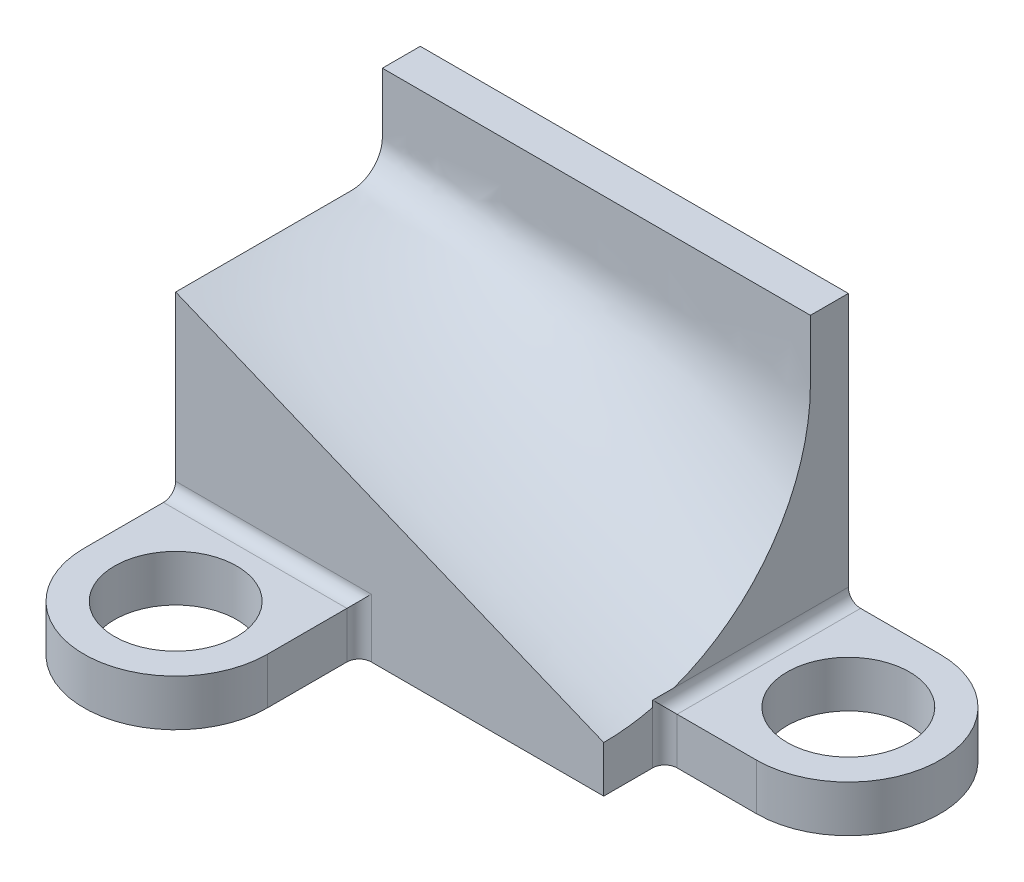
ISO-10303-21;
HEADER;
FILE_DESCRIPTION(('STEP AP214'),'2;1');
FILE_NAME('part.step','',(''),(''),'','','');
FILE_SCHEMA(('AUTOMOTIVE_DESIGN { 1 0 10303 214 1 1 1 1 }'));
ENDSEC;
DATA;
#1=APPLICATION_CONTEXT('core data for automotive mechanical design processes');
#2=APPLICATION_PROTOCOL_DEFINITION('international standard','automotive_design',2000,#1);
#3=PRODUCT_CONTEXT('',#1,'mechanical');
#4=PRODUCT('Part','Part','',(#3));
#5=PRODUCT_RELATED_PRODUCT_CATEGORY('part','',(#4));
#6=PRODUCT_DEFINITION_FORMATION('','',#4);
#7=PRODUCT_DEFINITION_CONTEXT('part definition',#1,'design');
#8=PRODUCT_DEFINITION('design','',#6,#7);
#9=PRODUCT_DEFINITION_SHAPE('','',#8);
#10=(LENGTH_UNIT() NAMED_UNIT(*) SI_UNIT(.MILLI.,.METRE.));
#11=(NAMED_UNIT(*) PLANE_ANGLE_UNIT() SI_UNIT($,.RADIAN.));
#12=(NAMED_UNIT(*) SI_UNIT($,.STERADIAN.) SOLID_ANGLE_UNIT());
#13=UNCERTAINTY_MEASURE_WITH_UNIT(LENGTH_MEASURE(1.E-05),#10,'distance_accuracy_value','');
#14=(GEOMETRIC_REPRESENTATION_CONTEXT(3) GLOBAL_UNCERTAINTY_ASSIGNED_CONTEXT((#13)) GLOBAL_UNIT_ASSIGNED_CONTEXT((#10,
#11,#12)) REPRESENTATION_CONTEXT('',''));
#15=CARTESIAN_POINT('',(0.,0.,0.));
#16=DIRECTION('',(0.,0.,1.));
#17=DIRECTION('',(1.,0.,0.));
#18=AXIS2_PLACEMENT_3D('',#15,#16,#17);
#19=CARTESIAN_POINT('',(0.,9.652,0.));
#20=DIRECTION('',(1.,0.,0.));
#21=DIRECTION('',(0.,0.,-1.));
#22=AXIS2_PLACEMENT_3D('',#19,#20,#21);
#23=PLANE('',#22);
#24=CARTESIAN_POINT('',(0.,52.578,0.));
#25=DIRECTION('',(1.,0.,0.));
#26=DIRECTION('',(0.,0.,-1.));
#27=AXIS2_PLACEMENT_3D('',#24,#25,#26);
#28=CIRCLE('',#27,42.926);
#29=CARTESIAN_POINT('',(0.,9.652,0.));
#30=VERTEX_POINT('',#29);
#31=CARTESIAN_POINT('',(0.,10.8716069884821,-10.1599999718182));
#32=VERTEX_POINT('',#31);
#33=EDGE_CURVE('E125',#30,#32,#28,.T.);
#34=ORIENTED_EDGE('',*,*,#33,.F.);
#35=DIRECTION('',(0.,-1.,0.));
#36=VECTOR('',#35,1.);
#37=CARTESIAN_POINT('',(0.,9.652,0.));
#38=LINE('',#37,#36);
#39=CARTESIAN_POINT('',(0.,0.,0.));
#40=VERTEX_POINT('',#39);
#41=EDGE_CURVE('E389',#30,#40,#38,.T.);
#42=ORIENTED_EDGE('',*,*,#41,.T.);
#43=DIRECTION('',(0.,0.,1.));
#44=VECTOR('',#43,1.);
#45=CARTESIAN_POINT('',(0.,0.,0.));
#46=LINE('',#45,#44);
#47=CARTESIAN_POINT('',(0.,0.,-10.16));
#48=VERTEX_POINT('',#47);
#49=EDGE_CURVE('E522',#48,#40,#46,.T.);
#50=ORIENTED_EDGE('',*,*,#49,.F.);
#51=DIRECTION('',(0.,-1.,0.));
#52=VECTOR('',#51,1.);
#53=CARTESIAN_POINT('',(0.,9.652,-10.16));
#54=LINE('',#53,#52);
#55=EDGE_CURVE('E383',#48,#32,#54,.F.);
#56=ORIENTED_EDGE('',*,*,#55,.T.);
#57=EDGE_LOOP('',(#34,#42,#50,#56));
#58=FACE_BOUND('',#57,.T.);
#59=ADVANCED_FACE('F121',(#58),#23,.T.);
#60=CARTESIAN_POINT('',(0.,9.652,0.));
#61=DIRECTION('',(0.,1.,0.));
#62=DIRECTION('',(0.,0.,1.));
#63=AXIS2_PLACEMENT_3D('',#60,#61,#62);
#64=PLANE('',#63);
#65=CARTESIAN_POINT('',(-69.85,9.652,19.05));
#66=DIRECTION('',(0.,1.,0.));
#67=DIRECTION('',(0.,0.,1.));
#68=AXIS2_PLACEMENT_3D('',#65,#66,#67);
#69=CIRCLE('',#68,12.7);
#70=CARTESIAN_POINT('',(-69.85,9.652,31.75));
#71=VERTEX_POINT('',#70);
#72=EDGE_CURVE('E499',#71,#71,#69,.T.);
#73=ORIENTED_EDGE('',*,*,#72,.F.);
#74=EDGE_LOOP('',(#73));
#75=FACE_BOUND('',#74,.T.);
#76=DIRECTION('',(0.,0.,-1.));
#77=VECTOR('',#76,1.);
#78=CARTESIAN_POINT('',(-50.8,9.652,0.));
#79=LINE('',#78,#77);
#80=CARTESIAN_POINT('',(-50.8,9.652,19.05));
#81=VERTEX_POINT('',#80);
#82=CARTESIAN_POINT('',(-50.8,9.652,2.54));
#83=VERTEX_POINT('',#82);
#84=EDGE_CURVE('E492',#81,#83,#79,.T.);
#85=ORIENTED_EDGE('',*,*,#84,.T.);
#86=DIRECTION('',(-1.,0.,0.));
#87=VECTOR('',#86,1.);
#88=CARTESIAN_POINT('',(0.,9.652,2.54));
#89=LINE('',#88,#87);
#90=CARTESIAN_POINT('',(-88.9,9.652,2.54));
#91=VERTEX_POINT('',#90);
#92=EDGE_CURVE('E139',#83,#91,#89,.T.);
#93=ORIENTED_EDGE('',*,*,#92,.T.);
#94=DIRECTION('',(0.,0.,1.));
#95=VECTOR('',#94,1.);
#96=CARTESIAN_POINT('',(-88.9,9.652,0.));
#97=LINE('',#96,#95);
#98=CARTESIAN_POINT('',(-88.9,9.652,19.05));
#99=VERTEX_POINT('',#98);
#100=EDGE_CURVE('E485',#91,#99,#97,.T.);
#101=ORIENTED_EDGE('',*,*,#100,.T.);
#102=CARTESIAN_POINT('',(-69.85,9.652,19.05));
#103=DIRECTION('',(0.,1.,0.));
#104=DIRECTION('',(0.,0.,1.));
#105=AXIS2_PLACEMENT_3D('',#102,#103,#104);
#106=CIRCLE('',#105,19.05);
#107=EDGE_CURVE('E489',#99,#81,#106,.T.);
#108=ORIENTED_EDGE('',*,*,#107,.T.);
#109=EDGE_LOOP('',(#85,#93,#101,#108));
#110=FACE_BOUND('',#109,.T.);
#111=ADVANCED_FACE('F581',(#75,#110),#64,.T.);
#112=CARTESIAN_POINT('',(0.,9.652,-12.7));
#113=DIRECTION('',(0.,0.,1.));
#114=DIRECTION('',(1.,0.,0.));
#115=AXIS2_PLACEMENT_3D('',#112,#113,#114);
#116=PLANE('',#115);
#117=DIRECTION('',(-1.,0.,0.));
#118=VECTOR('',#117,1.);
#119=CARTESIAN_POINT('',(0.,9.652,-12.7));
#120=LINE('',#119,#118);
#121=CARTESIAN_POINT('',(19.05,9.652,-12.7));
#122=VERTEX_POINT('',#121);
#123=CARTESIAN_POINT('',(2.54,9.652,-12.7));
#124=VERTEX_POINT('',#123);
#125=EDGE_CURVE('E530',#122,#124,#120,.T.);
#126=ORIENTED_EDGE('',*,*,#125,.T.);
#127=DIRECTION('',(0.,-1.,0.));
#128=VECTOR('',#127,1.);
#129=CARTESIAN_POINT('',(2.54,0.,-12.7));
#130=LINE('',#129,#128);
#131=CARTESIAN_POINT('',(2.54,0.,-12.7));
#132=VERTEX_POINT('',#131);
#133=EDGE_CURVE('E463',#124,#132,#130,.T.);
#134=ORIENTED_EDGE('',*,*,#133,.T.);
#135=DIRECTION('',(-1.,0.,0.));
#136=VECTOR('',#135,1.);
#137=CARTESIAN_POINT('',(0.,0.,-12.7));
#138=LINE('',#137,#136);
#139=CARTESIAN_POINT('',(19.05,0.,-12.7));
#140=VERTEX_POINT('',#139);
#141=EDGE_CURVE('E505',#140,#132,#138,.T.);
#142=ORIENTED_EDGE('',*,*,#141,.F.);
#143=DIRECTION('',(0.,-1.,0.));
#144=VECTOR('',#143,1.);
#145=CARTESIAN_POINT('',(19.05,9.652,-12.7));
#146=LINE('',#145,#144);
#147=EDGE_CURVE('E453',#122,#140,#146,.T.);
#148=ORIENTED_EDGE('',*,*,#147,.F.);
#149=EDGE_LOOP('',(#126,#134,#142,#148));
#150=FACE_BOUND('',#149,.T.);
#151=ADVANCED_FACE('F557',(#150),#116,.T.);
#152=CARTESIAN_POINT('',(19.05,9.652,-31.75));
#153=DIRECTION('',(0.,-1.,0.));
#154=DIRECTION('',(0.,0.,-1.));
#155=AXIS2_PLACEMENT_3D('',#152,#153,#154);
#156=CYLINDRICAL_SURFACE('',#155,19.05);
#157=CARTESIAN_POINT('',(19.05,0.,-31.75));
#158=DIRECTION('',(0.,1.,0.));
#159=DIRECTION('',(0.,0.,1.));
#160=AXIS2_PLACEMENT_3D('',#157,#158,#159);
#161=CIRCLE('',#160,19.05);
#162=CARTESIAN_POINT('',(19.05,0.,-50.8));
#163=VERTEX_POINT('',#162);
#164=EDGE_CURVE('E508',#140,#163,#161,.T.);
#165=ORIENTED_EDGE('',*,*,#164,.T.);
#166=DIRECTION('',(0.,-1.,0.));
#167=VECTOR('',#166,1.);
#168=CARTESIAN_POINT('',(19.05,9.652,-50.8));
#169=LINE('',#168,#167);
#170=CARTESIAN_POINT('',(19.05,9.652,-50.8));
#171=VERTEX_POINT('',#170);
#172=EDGE_CURVE('E539',#171,#163,#169,.T.);
#173=ORIENTED_EDGE('',*,*,#172,.F.);
#174=CARTESIAN_POINT('',(19.05,9.652,-31.75));
#175=DIRECTION('',(0.,1.,0.));
#176=DIRECTION('',(0.,0.,1.));
#177=AXIS2_PLACEMENT_3D('',#174,#175,#176);
#178=CIRCLE('',#177,19.05);
#179=EDGE_CURVE('E494',#122,#171,#178,.T.);
#180=ORIENTED_EDGE('',*,*,#179,.F.);
#181=ORIENTED_EDGE('',*,*,#147,.T.);
#182=EDGE_LOOP('',(#165,#173,#180,#181));
#183=FACE_BOUND('',#182,.T.);
#184=ADVANCED_FACE('F544',(#183),#156,.T.);
#185=CARTESIAN_POINT('',(0.,9.652,-50.8));
#186=DIRECTION('',(0.,0.,-1.));
#187=DIRECTION('',(-1.,0.,0.));
#188=AXIS2_PLACEMENT_3D('',#185,#186,#187);
#189=PLANE('',#188);
#190=ORIENTED_EDGE('',*,*,#172,.T.);
#191=DIRECTION('',(1.,0.,0.));
#192=VECTOR('',#191,1.);
#193=CARTESIAN_POINT('',(0.,0.,-50.8));
#194=LINE('',#193,#192);
#195=CARTESIAN_POINT('',(-88.9,0.,-50.8));
#196=VERTEX_POINT('',#195);
#197=EDGE_CURVE('E511',#196,#163,#194,.T.);
#198=ORIENTED_EDGE('',*,*,#197,.F.);
#199=DIRECTION('',(0.,-1.,0.));
#200=VECTOR('',#199,1.);
#201=CARTESIAN_POINT('',(-88.9,9.652,-50.8));
#202=LINE('',#201,#200);
#203=CARTESIAN_POINT('',(-88.9,65.024,-50.8));
#204=VERTEX_POINT('',#203);
#205=EDGE_CURVE('E537',#204,#196,#202,.T.);
#206=ORIENTED_EDGE('',*,*,#205,.F.);
#207=DIRECTION('',(1.,0.,0.));
#208=VECTOR('',#207,1.);
#209=CARTESIAN_POINT('',(0.,65.024,-50.8));
#210=LINE('',#209,#208);
#211=CARTESIAN_POINT('',(0.,65.024,-50.8));
#212=VERTEX_POINT('',#211);
#213=EDGE_CURVE('E375',#204,#212,#210,.T.);
#214=ORIENTED_EDGE('',*,*,#213,.T.);
#215=DIRECTION('',(0.,-1.,0.));
#216=VECTOR('',#215,1.);
#217=CARTESIAN_POINT('',(0.,65.024,-50.8));
#218=LINE('',#217,#216);
#219=CARTESIAN_POINT('',(0.,12.192,-50.8));
#220=VERTEX_POINT('',#219);
#221=EDGE_CURVE('E396',#212,#220,#218,.T.);
#222=ORIENTED_EDGE('',*,*,#221,.T.);
#223=CARTESIAN_POINT('',(2.54,12.192,-50.8));
#224=DIRECTION('',(0.,0.,-1.));
#225=DIRECTION('',(-1.,0.,0.));
#226=AXIS2_PLACEMENT_3D('',#223,#224,#225);
#227=CIRCLE('',#226,2.54);
#228=CARTESIAN_POINT('',(2.54,9.652,-50.8));
#229=VERTEX_POINT('',#228);
#230=EDGE_CURVE('E448',#220,#229,#227,.F.);
#231=ORIENTED_EDGE('',*,*,#230,.T.);
#232=DIRECTION('',(1.,0.,0.));
#233=VECTOR('',#232,1.);
#234=CARTESIAN_POINT('',(0.,9.652,-50.8));
#235=LINE('',#234,#233);
#236=EDGE_CURVE('E490',#229,#171,#235,.T.);
#237=ORIENTED_EDGE('',*,*,#236,.T.);
#238=EDGE_LOOP('',(#190,#198,#206,#214,#222,#231,#237));
#239=FACE_BOUND('',#238,.T.);
#240=ADVANCED_FACE('F280',(#239),#189,.T.);
#241=CARTESIAN_POINT('',(-88.9,9.652,0.));
#242=DIRECTION('',(1.,0.,0.));
#243=DIRECTION('',(0.,0.,-1.));
#244=AXIS2_PLACEMENT_3D('',#241,#242,#243);
#245=PLANE('',#244);
#246=DIRECTION('',(0.,-1.,0.));
#247=VECTOR('',#246,1.);
#248=CARTESIAN_POINT('',(-88.9,65.024,0.));
#249=LINE('',#248,#247);
#250=CARTESIAN_POINT('',(-88.9,46.228,0.));
#251=VERTEX_POINT('',#250);
#252=CARTESIAN_POINT('',(-88.9,12.192,0.));
#253=VERTEX_POINT('',#252);
#254=EDGE_CURVE('E388',#251,#253,#249,.T.);
#255=ORIENTED_EDGE('',*,*,#254,.F.);
#256=DIRECTION('',(0.,0.,1.));
#257=VECTOR('',#256,1.);
#258=CARTESIAN_POINT('',(-88.9,46.228,-36.576));
#259=LINE('',#258,#257);
#260=CARTESIAN_POINT('',(-88.9,46.228,-36.5760000000869));
#261=VERTEX_POINT('',#260);
#262=EDGE_CURVE('E254',#261,#251,#259,.T.);
#263=ORIENTED_EDGE('',*,*,#262,.F.);
#264=CARTESIAN_POINT('',(-88.9,52.578,-36.576));
#265=DIRECTION('',(-1.,0.,0.));
#266=DIRECTION('',(0.,0.,1.));
#267=AXIS2_PLACEMENT_3D('',#264,#265,#266);
#268=CIRCLE('',#267,6.35);
#269=CARTESIAN_POINT('',(-88.9,52.578,-42.926));
#270=VERTEX_POINT('',#269);
#271=EDGE_CURVE('E245',#270,#261,#268,.T.);
#272=ORIENTED_EDGE('',*,*,#271,.F.);
#273=DIRECTION('',(0.,-1.,0.));
#274=VECTOR('',#273,1.);
#275=CARTESIAN_POINT('',(-88.9,52.578,-42.926));
#276=LINE('',#275,#274);
#277=CARTESIAN_POINT('',(-88.9,65.024,-42.926));
#278=VERTEX_POINT('',#277);
#279=EDGE_CURVE('E241',#278,#270,#276,.T.);
#280=ORIENTED_EDGE('',*,*,#279,.F.);
#281=DIRECTION('',(0.,0.,1.));
#282=VECTOR('',#281,1.);
#283=CARTESIAN_POINT('',(-88.9,65.024,0.));
#284=LINE('',#283,#282);
#285=EDGE_CURVE('E386',#204,#278,#284,.T.);
#286=ORIENTED_EDGE('',*,*,#285,.F.);
#287=ORIENTED_EDGE('',*,*,#205,.T.);
#288=DIRECTION('',(0.,0.,1.));
#289=VECTOR('',#288,1.);
#290=CARTESIAN_POINT('',(-88.9,0.,0.));
#291=LINE('',#290,#289);
#292=CARTESIAN_POINT('',(-88.9,0.,19.05));
#293=VERTEX_POINT('',#292);
#294=EDGE_CURVE('E513',#196,#293,#291,.T.);
#295=ORIENTED_EDGE('',*,*,#294,.T.);
#296=DIRECTION('',(0.,-1.,0.));
#297=VECTOR('',#296,1.);
#298=CARTESIAN_POINT('',(-88.9,9.652,19.05));
#299=LINE('',#298,#297);
#300=EDGE_CURVE('E487',#99,#293,#299,.T.);
#301=ORIENTED_EDGE('',*,*,#300,.F.);
#302=ORIENTED_EDGE('',*,*,#100,.F.);
#303=CARTESIAN_POINT('',(-88.9,12.192,2.54));
#304=DIRECTION('',(1.,0.,0.));
#305=DIRECTION('',(0.,0.,-1.));
#306=AXIS2_PLACEMENT_3D('',#303,#304,#305);
#307=CIRCLE('',#306,2.54);
#308=EDGE_CURVE('E13',#91,#253,#307,.T.);
#309=ORIENTED_EDGE('',*,*,#308,.T.);
#310=EDGE_LOOP('',(#255,#263,#272,#280,#286,#287,#295,#301,#302,#309));
#311=FACE_BOUND('',#310,.T.);
#312=ADVANCED_FACE('F259',(#311),#245,.F.);
#313=CARTESIAN_POINT('',(-69.85,9.652,19.05));
#314=DIRECTION('',(0.,-1.,0.));
#315=DIRECTION('',(0.,0.,-1.));
#316=AXIS2_PLACEMENT_3D('',#313,#314,#315);
#317=CYLINDRICAL_SURFACE('',#316,19.05);
#318=CARTESIAN_POINT('',(-69.85,0.,19.05));
#319=DIRECTION('',(0.,1.,0.));
#320=DIRECTION('',(0.,0.,1.));
#321=AXIS2_PLACEMENT_3D('',#318,#319,#320);
#322=CIRCLE('',#321,19.05);
#323=CARTESIAN_POINT('',(-50.8,0.,19.05));
#324=VERTEX_POINT('',#323);
#325=EDGE_CURVE('E515',#293,#324,#322,.T.);
#326=ORIENTED_EDGE('',*,*,#325,.T.);
#327=DIRECTION('',(0.,-1.,0.));
#328=VECTOR('',#327,1.);
#329=CARTESIAN_POINT('',(-50.8,9.652,19.05));
#330=LINE('',#329,#328);
#331=EDGE_CURVE('E533',#81,#324,#330,.T.);
#332=ORIENTED_EDGE('',*,*,#331,.F.);
#333=ORIENTED_EDGE('',*,*,#107,.F.);
#334=ORIENTED_EDGE('',*,*,#300,.T.);
#335=EDGE_LOOP('',(#326,#332,#333,#334));
#336=FACE_BOUND('',#335,.T.);
#337=ADVANCED_FACE('F279',(#336),#317,.T.);
#338=CARTESIAN_POINT('',(-50.8,9.652,0.));
#339=DIRECTION('',(-1.,0.,0.));
#340=DIRECTION('',(0.,0.,1.));
#341=AXIS2_PLACEMENT_3D('',#338,#339,#340);
#342=PLANE('',#341);
#343=DIRECTION('',(0.,0.,-1.));
#344=VECTOR('',#343,1.);
#345=CARTESIAN_POINT('',(-50.8,0.,0.));
#346=LINE('',#345,#344);
#347=CARTESIAN_POINT('',(-50.8,0.,2.54));
#348=VERTEX_POINT('',#347);
#349=EDGE_CURVE('E517',#324,#348,#346,.T.);
#350=ORIENTED_EDGE('',*,*,#349,.T.);
#351=DIRECTION('',(0.,-1.,0.));
#352=VECTOR('',#351,1.);
#353=CARTESIAN_POINT('',(-50.8,9.652,2.54));
#354=LINE('',#353,#352);
#355=EDGE_CURVE('E147',#348,#83,#354,.F.);
#356=ORIENTED_EDGE('',*,*,#355,.T.);
#357=ORIENTED_EDGE('',*,*,#84,.F.);
#358=ORIENTED_EDGE('',*,*,#331,.T.);
#359=EDGE_LOOP('',(#350,#356,#357,#358));
#360=FACE_BOUND('',#359,.T.);
#361=ADVANCED_FACE('F570',(#360),#342,.F.);
#362=CARTESIAN_POINT('',(0.,9.652,0.));
#363=DIRECTION('',(0.,0.,-1.));
#364=DIRECTION('',(-1.,0.,0.));
#365=AXIS2_PLACEMENT_3D('',#362,#363,#364);
#366=PLANE('',#365);
#367=ORIENTED_EDGE('',*,*,#41,.F.);
#368=CARTESIAN_POINT('',(-88.9,46.228,0.));
#369=CARTESIAN_POINT('',(-59.2666666666667,34.036,0.));
#370=CARTESIAN_POINT('',(-29.6333333333333,21.844,0.));
#371=CARTESIAN_POINT('',(0.,9.652,0.));
#372=B_SPLINE_CURVE_WITH_KNOTS('',3,(#368,#369,#370,#371),.UNSPECIFIED.,.F.,.F.,(4,4),(0.,1.),.UNSPECIFIED.);
#373=EDGE_CURVE('E296',#251,#30,#372,.T.);
#374=ORIENTED_EDGE('',*,*,#373,.F.);
#375=ORIENTED_EDGE('',*,*,#254,.T.);
#376=DIRECTION('',(-1.,0.,0.));
#377=VECTOR('',#376,1.);
#378=CARTESIAN_POINT('',(0.,12.192,0.));
#379=LINE('',#378,#377);
#380=CARTESIAN_POINT('',(-48.26,12.192,0.));
#381=VERTEX_POINT('',#380);
#382=EDGE_CURVE('E465',#253,#381,#379,.F.);
#383=ORIENTED_EDGE('',*,*,#382,.T.);
#384=DIRECTION('',(0.,-1.,0.));
#385=VECTOR('',#384,1.);
#386=CARTESIAN_POINT('',(-48.26,0.,0.));
#387=LINE('',#386,#385);
#388=CARTESIAN_POINT('',(-48.26,0.,0.));
#389=VERTEX_POINT('',#388);
#390=EDGE_CURVE('E467',#381,#389,#387,.T.);
#391=ORIENTED_EDGE('',*,*,#390,.T.);
#392=DIRECTION('',(1.,0.,0.));
#393=VECTOR('',#392,1.);
#394=CARTESIAN_POINT('',(0.,0.,0.));
#395=LINE('',#394,#393);
#396=EDGE_CURVE('E519',#389,#40,#395,.T.);
#397=ORIENTED_EDGE('',*,*,#396,.T.);
#398=EDGE_LOOP('',(#367,#374,#375,#383,#391,#397));
#399=FACE_BOUND('',#398,.T.);
#400=ADVANCED_FACE('F420',(#399),#366,.F.);
#401=CARTESIAN_POINT('',(-69.85,9.652,19.05));
#402=DIRECTION('',(0.,-1.,0.));
#403=DIRECTION('',(0.,0.,-1.));
#404=AXIS2_PLACEMENT_3D('',#401,#402,#403);
#405=CYLINDRICAL_SURFACE('',#404,12.7);
#406=ORIENTED_EDGE('',*,*,#72,.T.);
#407=EDGE_LOOP('',(#406));
#408=FACE_BOUND('',#407,.T.);
#409=CARTESIAN_POINT('',(-69.85,0.,19.05));
#410=DIRECTION('',(0.,1.,0.));
#411=DIRECTION('',(0.,0.,1.));
#412=AXIS2_PLACEMENT_3D('',#409,#410,#411);
#413=CIRCLE('',#412,12.7);
#414=CARTESIAN_POINT('',(-69.85,0.,31.75));
#415=VERTEX_POINT('',#414);
#416=EDGE_CURVE('E525',#415,#415,#413,.T.);
#417=ORIENTED_EDGE('',*,*,#416,.F.);
#418=EDGE_LOOP('',(#417));
#419=FACE_BOUND('',#418,.T.);
#420=ADVANCED_FACE('F417',(#408,#419),#405,.F.);
#421=CARTESIAN_POINT('',(0.,12.1919999458325,-14.5471529635617));
#422=VERTEX_POINT('',#421);
#423=CARTESIAN_POINT('',(0.,52.5780000000014,-42.926));
#424=VERTEX_POINT('',#423);
#425=EDGE_CURVE('E288',#422,#424,#28,.T.);
#426=ORIENTED_EDGE('',*,*,#425,.F.);
#427=DIRECTION('',(0.,0.,-1.));
#428=VECTOR('',#427,1.);
#429=CARTESIAN_POINT('',(0.,12.192,-50.8));
#430=LINE('',#429,#428);
#431=EDGE_CURVE('E440',#422,#220,#430,.T.);
#432=ORIENTED_EDGE('',*,*,#431,.T.);
#433=ORIENTED_EDGE('',*,*,#221,.F.);
#434=DIRECTION('',(0.,0.,1.));
#435=VECTOR('',#434,1.);
#436=CARTESIAN_POINT('',(0.,65.024,0.));
#437=LINE('',#436,#435);
#438=CARTESIAN_POINT('',(0.,65.024,-42.926));
#439=VERTEX_POINT('',#438);
#440=EDGE_CURVE('E378',#212,#439,#437,.T.);
#441=ORIENTED_EDGE('',*,*,#440,.T.);
#442=DIRECTION('',(0.,1.,0.));
#443=VECTOR('',#442,1.);
#444=CARTESIAN_POINT('',(0.,52.578,-42.926));
#445=LINE('',#444,#443);
#446=EDGE_CURVE('E297',#424,#439,#445,.T.);
#447=ORIENTED_EDGE('',*,*,#446,.F.);
#448=EDGE_LOOP('',(#426,#432,#433,#441,#447));
#449=FACE_BOUND('',#448,.T.);
#450=ADVANCED_FACE('F406',(#449),#23,.T.);
#451=CARTESIAN_POINT('',(19.05,9.652,-31.75));
#452=DIRECTION('',(0.,-1.,0.));
#453=DIRECTION('',(0.,0.,-1.));
#454=AXIS2_PLACEMENT_3D('',#451,#452,#453);
#455=CYLINDRICAL_SURFACE('',#454,12.7);
#456=CARTESIAN_POINT('',(19.05,9.652,-31.75));
#457=DIRECTION('',(0.,1.,0.));
#458=DIRECTION('',(0.,0.,1.));
#459=AXIS2_PLACEMENT_3D('',#456,#457,#458);
#460=CIRCLE('',#459,12.7);
#461=CARTESIAN_POINT('',(19.05,9.652,-19.05));
#462=VERTEX_POINT('',#461);
#463=EDGE_CURVE('E502',#462,#462,#460,.T.);
#464=ORIENTED_EDGE('',*,*,#463,.T.);
#465=EDGE_LOOP('',(#464));
#466=FACE_BOUND('',#465,.T.);
#467=CARTESIAN_POINT('',(19.05,0.,-31.75));
#468=DIRECTION('',(0.,1.,0.));
#469=DIRECTION('',(0.,0.,1.));
#470=AXIS2_PLACEMENT_3D('',#467,#468,#469);
#471=CIRCLE('',#470,12.7);
#472=CARTESIAN_POINT('',(19.05,0.,-19.05));
#473=VERTEX_POINT('',#472);
#474=EDGE_CURVE('E528',#473,#473,#471,.T.);
#475=ORIENTED_EDGE('',*,*,#474,.F.);
#476=EDGE_LOOP('',(#475));
#477=FACE_BOUND('',#476,.T.);
#478=ADVANCED_FACE('F416',(#466,#477),#455,.F.);
#479=ORIENTED_EDGE('',*,*,#236,.F.);
#480=DIRECTION('',(0.,0.,-1.));
#481=VECTOR('',#480,1.);
#482=CARTESIAN_POINT('',(2.54,9.652,-12.7));
#483=LINE('',#482,#481);
#484=EDGE_CURVE('E451',#229,#124,#483,.F.);
#485=ORIENTED_EDGE('',*,*,#484,.T.);
#486=ORIENTED_EDGE('',*,*,#125,.F.);
#487=ORIENTED_EDGE('',*,*,#179,.T.);
#488=EDGE_LOOP('',(#479,#485,#486,#487));
#489=FACE_BOUND('',#488,.T.);
#490=ORIENTED_EDGE('',*,*,#463,.F.);
#491=EDGE_LOOP('',(#490));
#492=FACE_BOUND('',#491,.T.);
#493=ADVANCED_FACE('F577',(#489,#492),#64,.T.);
#494=CARTESIAN_POINT('',(0.,0.,0.));
#495=DIRECTION('',(0.,1.,0.));
#496=DIRECTION('',(0.,0.,1.));
#497=AXIS2_PLACEMENT_3D('',#494,#495,#496);
#498=PLANE('',#497);
#499=ORIENTED_EDGE('',*,*,#141,.T.);
#500=CARTESIAN_POINT('',(2.54,0.,-10.16));
#501=DIRECTION('',(0.,1.,0.));
#502=DIRECTION('',(0.,0.,1.));
#503=AXIS2_PLACEMENT_3D('',#500,#501,#502);
#504=CIRCLE('',#503,2.54);
#505=EDGE_CURVE('E473',#132,#48,#504,.T.);
#506=ORIENTED_EDGE('',*,*,#505,.T.);
#507=ORIENTED_EDGE('',*,*,#49,.T.);
#508=ORIENTED_EDGE('',*,*,#396,.F.);
#509=CARTESIAN_POINT('',(-48.26,0.,2.54));
#510=DIRECTION('',(0.,1.,0.));
#511=DIRECTION('',(0.,0.,1.));
#512=AXIS2_PLACEMENT_3D('',#509,#510,#511);
#513=CIRCLE('',#512,2.54);
#514=EDGE_CURVE('E131',#389,#348,#513,.T.);
#515=ORIENTED_EDGE('',*,*,#514,.T.);
#516=ORIENTED_EDGE('',*,*,#349,.F.);
#517=ORIENTED_EDGE('',*,*,#325,.F.);
#518=ORIENTED_EDGE('',*,*,#294,.F.);
#519=ORIENTED_EDGE('',*,*,#197,.T.);
#520=ORIENTED_EDGE('',*,*,#164,.F.);
#521=EDGE_LOOP('',(#499,#506,#507,#508,#515,#516,#517,#518,#519,#520));
#522=FACE_BOUND('',#521,.T.);
#523=ORIENTED_EDGE('',*,*,#474,.T.);
#524=EDGE_LOOP('',(#523));
#525=FACE_BOUND('',#524,.T.);
#526=ORIENTED_EDGE('',*,*,#416,.T.);
#527=EDGE_LOOP('',(#526));
#528=FACE_BOUND('',#527,.T.);
#529=ADVANCED_FACE('F552',(#522,#525,#528),#498,.F.);
#530=CARTESIAN_POINT('',(0.,65.024,0.));
#531=DIRECTION('',(0.,1.,0.));
#532=DIRECTION('',(0.,0.,1.));
#533=AXIS2_PLACEMENT_3D('',#530,#531,#532);
#534=PLANE('',#533);
#535=CARTESIAN_POINT('',(-88.9,65.024,-42.926));
#536=CARTESIAN_POINT('',(-59.2666666666667,65.024,-42.926));
#537=CARTESIAN_POINT('',(-29.6333333333333,65.024,-42.926));
#538=CARTESIAN_POINT('',(0.,65.024,-42.926));
#539=B_SPLINE_CURVE_WITH_KNOTS('',3,(#535,#536,#537,#538),.UNSPECIFIED.,.F.,.F.,(4,4),(0.,1.),.UNSPECIFIED.);
#540=EDGE_CURVE('E249',#278,#439,#539,.T.);
#541=ORIENTED_EDGE('',*,*,#540,.T.);
#542=ORIENTED_EDGE('',*,*,#440,.F.);
#543=ORIENTED_EDGE('',*,*,#213,.F.);
#544=ORIENTED_EDGE('',*,*,#285,.T.);
#545=EDGE_LOOP('',(#541,#542,#543,#544));
#546=FACE_BOUND('',#545,.T.);
#547=ADVANCED_FACE('F589',(#546),#534,.T.);
#548=CARTESIAN_POINT('',(2.54,9.652,-10.16));
#549=DIRECTION('',(0.,1.,0.));
#550=DIRECTION('',(0.,0.,1.));
#551=AXIS2_PLACEMENT_3D('',#548,#549,#550);
#552=CYLINDRICAL_SURFACE('',#551,2.54);
#553=ORIENTED_EDGE('',*,*,#505,.F.);
#554=ORIENTED_EDGE('',*,*,#133,.F.);
#555=CARTESIAN_POINT('',(2.54,12.192,-10.16));
#556=DIRECTION('',(0.,0.707106781186547,-0.707106781186547));
#557=DIRECTION('',(0.,0.707106781186547,0.707106781186547));
#558=AXIS2_PLACEMENT_3D('',#555,#556,#557);
#559=ELLIPSE('',#558,3.59210244842766,2.54);
#560=CARTESIAN_POINT('',(0.,12.192,-10.16));
#561=VERTEX_POINT('',#560);
#562=EDGE_CURVE('E382',#561,#124,#559,.F.);
#563=ORIENTED_EDGE('',*,*,#562,.F.);
#564=DIRECTION('',(0.,1.,0.));
#565=VECTOR('',#564,1.);
#566=CARTESIAN_POINT('',(0.,9.652,-10.16));
#567=LINE('',#566,#565);
#568=EDGE_CURVE('E367',#561,#32,#567,.F.);
#569=ORIENTED_EDGE('',*,*,#568,.T.);
#570=ORIENTED_EDGE('',*,*,#55,.F.);
#571=EDGE_LOOP('',(#553,#554,#563,#569,#570));
#572=FACE_BOUND('',#571,.T.);
#573=ADVANCED_FACE('F560',(#572),#552,.F.);
#574=CARTESIAN_POINT('',(2.54,12.192,0.));
#575=DIRECTION('',(0.,0.,1.));
#576=DIRECTION('',(1.,0.,0.));
#577=AXIS2_PLACEMENT_3D('',#574,#575,#576);
#578=CYLINDRICAL_SURFACE('',#577,2.54);
#579=ORIENTED_EDGE('',*,*,#562,.T.);
#580=ORIENTED_EDGE('',*,*,#484,.F.);
#581=ORIENTED_EDGE('',*,*,#230,.F.);
#582=ORIENTED_EDGE('',*,*,#431,.F.);
#583=EDGE_CURVE('E446',#561,#422,#430,.T.);
#584=ORIENTED_EDGE('',*,*,#583,.F.);
#585=EDGE_LOOP('',(#579,#580,#581,#582,#584));
#586=FACE_BOUND('',#585,.T.);
#587=ADVANCED_FACE('F445',(#586),#578,.F.);
#588=CARTESIAN_POINT('',(0.,12.192,2.54));
#589=DIRECTION('',(-1.,0.,0.));
#590=DIRECTION('',(0.,0.,1.));
#591=AXIS2_PLACEMENT_3D('',#588,#589,#590);
#592=CYLINDRICAL_SURFACE('',#591,2.54);
#593=ORIENTED_EDGE('',*,*,#308,.F.);
#594=ORIENTED_EDGE('',*,*,#92,.F.);
#595=CARTESIAN_POINT('',(-48.26,12.192,2.54));
#596=DIRECTION('',(-0.707106781186547,0.707106781186547,0.));
#597=DIRECTION('',(-0.707106781186547,-0.707106781186547,0.));
#598=AXIS2_PLACEMENT_3D('',#595,#596,#597);
#599=ELLIPSE('',#598,3.59210244842766,2.54);
#600=EDGE_CURVE('E370',#381,#83,#599,.T.);
#601=ORIENTED_EDGE('',*,*,#600,.F.);
#602=ORIENTED_EDGE('',*,*,#382,.F.);
#603=EDGE_LOOP('',(#593,#594,#601,#602));
#604=FACE_BOUND('',#603,.T.);
#605=ADVANCED_FACE('F123',(#604),#592,.F.);
#606=CARTESIAN_POINT('',(-48.26,9.652,2.54));
#607=DIRECTION('',(0.,1.,0.));
#608=DIRECTION('',(0.,0.,1.));
#609=AXIS2_PLACEMENT_3D('',#606,#607,#608);
#610=CYLINDRICAL_SURFACE('',#609,2.54);
#611=ORIENTED_EDGE('',*,*,#600,.T.);
#612=ORIENTED_EDGE('',*,*,#355,.F.);
#613=ORIENTED_EDGE('',*,*,#514,.F.);
#614=ORIENTED_EDGE('',*,*,#390,.F.);
#615=EDGE_LOOP('',(#611,#612,#613,#614));
#616=FACE_BOUND('',#615,.T.);
#617=ADVANCED_FACE('F480',(#616),#610,.F.);
#618=CARTESIAN_POINT('',(0.,52.578,0.));
#619=DIRECTION('',(1.,0.,0.));
#620=DIRECTION('',(0.,0.,-1.));
#621=AXIS2_PLACEMENT_3D('',#618,#619,#620);
#622=PLANE('',#621);
#623=ORIENTED_EDGE('',*,*,#583,.T.);
#624=EDGE_CURVE('E295',#32,#422,#28,.T.);
#625=ORIENTED_EDGE('',*,*,#624,.F.);
#626=ORIENTED_EDGE('',*,*,#568,.F.);
#627=EDGE_LOOP('',(#623,#625,#626));
#628=FACE_BOUND('',#627,.T.);
#629=ADVANCED_FACE('F328',(#628),#622,.F.);
#630=CARTESIAN_POINT('',(-88.9,46.228,0.));
#631=CARTESIAN_POINT('',(-59.2666666666667,34.036,0.));
#632=CARTESIAN_POINT('',(-29.6333333333333,21.844,0.));
#633=CARTESIAN_POINT('',(0.,9.652,0.));
#634=CARTESIAN_POINT('',(-88.9,46.228,-1.30442964162759));
#635=CARTESIAN_POINT('',(-59.2666666666667,34.036,-1.72953606517771));
#636=CARTESIAN_POINT('',(-29.6333333333333,21.844,-2.15464248872782));
#637=CARTESIAN_POINT('',(0.,9.652,-2.57974891227794));
#638=CARTESIAN_POINT('',(-88.9,46.228,-3.99230753484898));
#639=CARTESIAN_POINT('',(-59.2666666666667,34.189781701467,-5.17395119729429));
#640=CARTESIAN_POINT('',(-29.6333333333333,22.151563402934,-6.3555948597396));
#641=CARTESIAN_POINT('',(0.,10.1133451044009,-7.53723852218491));
#642=CARTESIAN_POINT('',(-88.9,46.228,-8.25561301321939));
#643=CARTESIAN_POINT('',(-59.2666666666666,34.7961302489493,-10.2935123160565));
#644=CARTESIAN_POINT('',(-29.6333333333333,23.3642604978985,-12.3314116188937));
#645=CARTESIAN_POINT('',(0.,11.9323907468478,-14.3693109217308));
#646=CARTESIAN_POINT('',(-88.9,46.228,-12.7448399387678));
#647=CARTESIAN_POINT('',(-59.2666666666667,35.7216080900252,-15.3566668410864));
#648=CARTESIAN_POINT('',(-29.6333333333333,25.2152161800503,-17.968493743405));
#649=CARTESIAN_POINT('',(0.,14.7088242700755,-20.5803206457235));
#650=CARTESIAN_POINT('',(-88.9000000000001,46.228,-18.9712219566253));
#651=CARTESIAN_POINT('',(-59.2666666666667,37.3272234056087,-21.9797205131473));
#652=CARTESIAN_POINT('',(-29.6333333333334,28.4264468112174,-24.9882190696692));
#653=CARTESIAN_POINT('',(0.,19.5256702168262,-27.9967176261912));
#654=CARTESIAN_POINT('',(-88.8999999999999,46.228,-27.0921938002255));
#655=CARTESIAN_POINT('',(-59.2666666666666,39.9470062767799,-29.9138860316171));
#656=CARTESIAN_POINT('',(-29.6333333333333,33.6660125535598,-32.7355782630088));
#657=CARTESIAN_POINT('',(0.,27.3850188303398,-35.5572704944005));
#658=CARTESIAN_POINT('',(-88.9,46.228,-33.4950496144692));
#659=CARTESIAN_POINT('',(-59.2666666666667,42.5677263019337,-35.5049251488913));
#660=CARTESIAN_POINT('',(-29.6333333333333,38.9074526038673,-37.5148006833134));
#661=CARTESIAN_POINT('',(0.,35.247178905801,-39.5246762177355));
#662=CARTESIAN_POINT('',(-88.9,46.228,-37.3742626655375));
#663=CARTESIAN_POINT('',(-59.2666666666667,44.3516512955552,-38.6618043256575));
#664=CARTESIAN_POINT('',(-29.6333333333333,42.4753025911104,-39.9493459857776));
#665=CARTESIAN_POINT('',(0.,40.5989538866656,-41.2368876458976));
#666=CARTESIAN_POINT('',(-88.8999999999999,46.531522565009,-38.9772673844557));
#667=CARTESIAN_POINT('',(-59.2666666666666,45.2977926440122,-39.9355384068587));
#668=CARTESIAN_POINT('',(-29.6333333333333,44.0640627230154,-40.8938094292617));
#669=CARTESIAN_POINT('',(0.,42.8303328020186,-41.8520804516647));
#670=CARTESIAN_POINT('',(-88.9000000000001,47.8701797122418,-41.0754812613988));
#671=CARTESIAN_POINT('',(-59.2666666666668,47.3070076343856,-41.5473029066546));
#672=CARTESIAN_POINT('',(-29.6333333333334,46.7438355565293,-42.0191245519103));
#673=CARTESIAN_POINT('',(0.,46.1806634786731,-42.490946197166));
#674=CARTESIAN_POINT('',(-88.8999999999999,49.9579469707434,-42.5496904908692));
#675=CARTESIAN_POINT('',(-59.2666666666666,49.791428902737,-42.6507982826272));
#676=CARTESIAN_POINT('',(-29.6333333333333,49.6249108347307,-42.7519060743852));
#677=CARTESIAN_POINT('',(0.,49.4583927667243,-42.8530138661432));
#678=CARTESIAN_POINT('',(-88.9,51.6883046811647,-42.926));
#679=CARTESIAN_POINT('',(-59.2666666666667,51.6444273942953,-42.926));
#680=CARTESIAN_POINT('',(-29.6333333333333,51.600550107426,-42.926));
#681=CARTESIAN_POINT('',(0.,51.5566728205566,-42.926));
#682=CARTESIAN_POINT('',(-88.9,53.5566843983048,-42.926));
#683=CARTESIAN_POINT('',(-59.2666666666667,53.6049503772077,-42.926));
#684=CARTESIAN_POINT('',(-29.6333333333333,53.6532163561106,-42.926));
#685=CARTESIAN_POINT('',(0.,53.7014823350135,-42.926));
#686=CARTESIAN_POINT('',(-88.9,55.5667387438893,-42.926));
#687=CARTESIAN_POINT('',(-59.2666666666667,55.6611533056497,-42.926));
#688=CARTESIAN_POINT('',(-29.6333333333333,55.7555678674101,-42.926));
#689=CARTESIAN_POINT('',(0.,55.8499824291706,-42.926));
#690=CARTESIAN_POINT('',(-88.9000000000001,58.6979916247844,-42.926));
#691=CARTESIAN_POINT('',(-59.2666666666667,58.7743203797087,-42.926));
#692=CARTESIAN_POINT('',(-29.6333333333334,58.850649134633,-42.926));
#693=CARTESIAN_POINT('',(0.,58.9269778895573,-42.926));
#694=CARTESIAN_POINT('',(-88.9,61.881051318953,-42.926));
#695=CARTESIAN_POINT('',(-59.2666666666667,61.9045509082304,-42.926));
#696=CARTESIAN_POINT('',(-29.6333333333333,61.9280504975077,-42.926));
#697=CARTESIAN_POINT('',(0.,61.9515500867851,-42.926));
#698=CARTESIAN_POINT('',(-88.9,63.9868333333333,-42.926));
#699=CARTESIAN_POINT('',(-59.2666666666667,63.9868333333333,-42.926));
#700=CARTESIAN_POINT('',(-29.6333333333333,63.9868333333334,-42.926));
#701=CARTESIAN_POINT('',(0.,63.9868333333333,-42.926));
#702=CARTESIAN_POINT('',(-88.9,65.024,-42.926));
#703=CARTESIAN_POINT('',(-59.2666666666667,65.024,-42.926));
#704=CARTESIAN_POINT('',(-29.6333333333333,65.024,-42.926));
#705=CARTESIAN_POINT('',(0.,65.024,-42.926));
#706=B_SPLINE_SURFACE_WITH_KNOTS('',3,3,((#630,#631,#632,#633),(#634,#635,#636,#637),(#638,#639,
#640,#641),(#642,#643,#644,#645),(#646,#647,#648,#649),(#650,#651,#652,#653),(#654,#655,#656,
#657),(#658,#659,#660,#661),(#662,#663,#664,#665),(#666,#667,#668,#669),(#670,#671,#672,#673),
(#674,#675,#676,#677),(#678,#679,#680,#681),(#682,#683,#684,#685),(#686,#687,#688,#689),(#690,
#691,#692,#693),(#694,#695,#696,#697),(#698,#699,#700,#701),(#702,#703,#704,#705)),
.UNSPECIFIED.,.F.,.F.,.F.,(4,1,1,1,1,1,2,1,1,1,2,1,1,1,4),(4,4),(0.,0.0379267861258608,
0.0758535722517217,0.113780358377583,0.151707144503443,0.227560716755165,0.303414289006887,
0.323067664619345,0.342721040231803,0.362374415844261,0.38202779145672,0.403646936296061,
0.425266081135403,0.446885225974745,0.468504370814087),(0.,1.),.UNSPECIFIED.);
#707=ORIENTED_EDGE('',*,*,#262,.T.);
#708=ORIENTED_EDGE('',*,*,#373,.T.);
#709=ORIENTED_EDGE('',*,*,#33,.T.);
#710=ORIENTED_EDGE('',*,*,#624,.T.);
#711=ORIENTED_EDGE('',*,*,#425,.T.);
#712=ORIENTED_EDGE('',*,*,#446,.T.);
#713=ORIENTED_EDGE('',*,*,#540,.F.);
#714=ORIENTED_EDGE('',*,*,#279,.T.);
#715=ORIENTED_EDGE('',*,*,#271,.T.);
#716=EDGE_LOOP('',(#707,#708,#709,#710,#711,#712,#713,#714,#715));
#717=FACE_BOUND('',#716,.T.);
#718=ADVANCED_FACE('F244',(#717),#706,.F.);
#719=CLOSED_SHELL('',(#59,#111,#151,#184,#240,#312,#337,#361,#400,#420,#450,#478,#493,#529,#547,
#573,#587,#605,#617,#629,#718));
#720=MANIFOLD_SOLID_BREP('B2',#719);
#721=ADVANCED_BREP_SHAPE_REPRESENTATION('',(#18,#720),#14);
#722=SHAPE_DEFINITION_REPRESENTATION(#9,#721);
ENDSEC;
END-ISO-10303-21;
